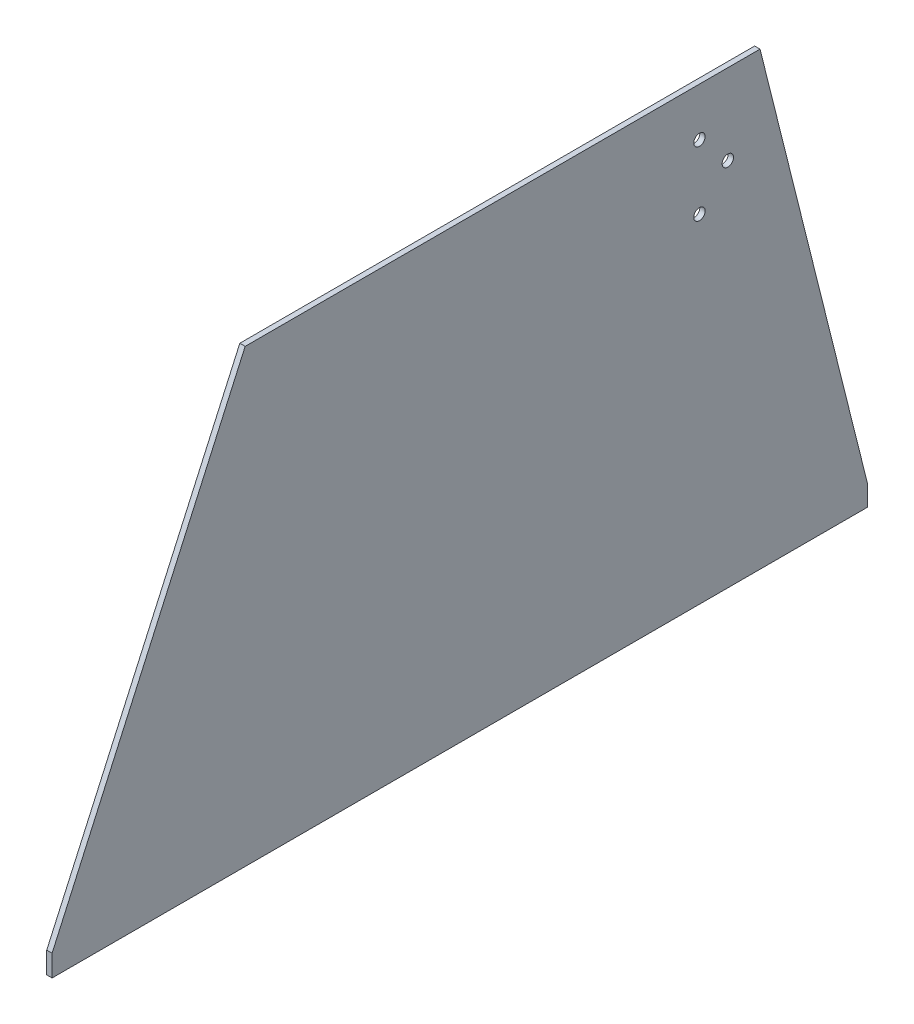
ISO-10303-21;
HEADER;
FILE_DESCRIPTION(('STEP AP214'),'2;1');
FILE_NAME('part.step','',(''),(''),'','','');
FILE_SCHEMA(('AUTOMOTIVE_DESIGN { 1 0 10303 214 1 1 1 1 }'));
ENDSEC;
DATA;
#1=APPLICATION_CONTEXT('core data for automotive mechanical design processes');
#2=APPLICATION_PROTOCOL_DEFINITION('international standard','automotive_design',2000,#1);
#3=PRODUCT_CONTEXT('',#1,'mechanical');
#4=PRODUCT('Part','Part','',(#3));
#5=PRODUCT_RELATED_PRODUCT_CATEGORY('part','',(#4));
#6=PRODUCT_DEFINITION_FORMATION('','',#4);
#7=PRODUCT_DEFINITION_CONTEXT('part definition',#1,'design');
#8=PRODUCT_DEFINITION('design','',#6,#7);
#9=PRODUCT_DEFINITION_SHAPE('','',#8);
#10=(LENGTH_UNIT() NAMED_UNIT(*) SI_UNIT(.MILLI.,.METRE.));
#11=(NAMED_UNIT(*) PLANE_ANGLE_UNIT() SI_UNIT($,.RADIAN.));
#12=(NAMED_UNIT(*) SI_UNIT($,.STERADIAN.) SOLID_ANGLE_UNIT());
#13=UNCERTAINTY_MEASURE_WITH_UNIT(LENGTH_MEASURE(1.E-05),#10,'distance_accuracy_value','');
#14=(GEOMETRIC_REPRESENTATION_CONTEXT(3) GLOBAL_UNCERTAINTY_ASSIGNED_CONTEXT((#13)) GLOBAL_UNIT_ASSIGNED_CONTEXT((#10,
#11,#12)) REPRESENTATION_CONTEXT('',''));
#15=CARTESIAN_POINT('',(0.,0.,0.));
#16=DIRECTION('',(0.,0.,1.));
#17=DIRECTION('',(1.,0.,0.));
#18=AXIS2_PLACEMENT_3D('',#15,#16,#17);
#19=CARTESIAN_POINT('',(3.175,12.7,0.));
#20=DIRECTION('',(0.,0.,-1.));
#21=DIRECTION('',(-1.,0.,0.));
#22=AXIS2_PLACEMENT_3D('',#19,#20,#21);
#23=PLANE('',#22);
#24=DIRECTION('',(0.,-1.,0.));
#25=VECTOR('',#24,1.);
#26=CARTESIAN_POINT('',(0.,12.7,0.));
#27=LINE('',#26,#25);
#28=CARTESIAN_POINT('',(0.,12.7,0.));
#29=VERTEX_POINT('',#28);
#30=CARTESIAN_POINT('',(0.,0.,0.));
#31=VERTEX_POINT('',#30);
#32=EDGE_CURVE('E116',#29,#31,#27,.T.);
#33=ORIENTED_EDGE('',*,*,#32,.T.);
#34=DIRECTION('',(-1.,0.,0.));
#35=VECTOR('',#34,1.);
#36=CARTESIAN_POINT('',(3.175,0.,0.));
#37=LINE('',#36,#35);
#38=CARTESIAN_POINT('',(3.175,0.,0.));
#39=VERTEX_POINT('',#38);
#40=EDGE_CURVE('E11',#39,#31,#37,.T.);
#41=ORIENTED_EDGE('',*,*,#40,.F.);
#42=DIRECTION('',(0.,-1.,0.));
#43=VECTOR('',#42,1.);
#44=CARTESIAN_POINT('',(3.175,12.7,0.));
#45=LINE('',#44,#43);
#46=CARTESIAN_POINT('',(3.175,12.7,0.));
#47=VERTEX_POINT('',#46);
#48=EDGE_CURVE('E127',#47,#39,#45,.T.);
#49=ORIENTED_EDGE('',*,*,#48,.F.);
#50=DIRECTION('',(-1.,0.,0.));
#51=VECTOR('',#50,1.);
#52=CARTESIAN_POINT('',(3.175,12.7,0.));
#53=LINE('',#52,#51);
#54=EDGE_CURVE('E112',#47,#29,#53,.T.);
#55=ORIENTED_EDGE('',*,*,#54,.T.);
#56=EDGE_LOOP('',(#33,#41,#49,#55));
#57=FACE_BOUND('',#56,.T.);
#58=ADVANCED_FACE('F32',(#57),#23,.F.);
#59=CARTESIAN_POINT('',(3.175,0.,-482.6));
#60=DIRECTION('',(0.,1.,0.));
#61=DIRECTION('',(0.,0.,1.));
#62=AXIS2_PLACEMENT_3D('',#59,#60,#61);
#63=PLANE('',#62);
#64=DIRECTION('',(0.,0.,-1.));
#65=VECTOR('',#64,1.);
#66=CARTESIAN_POINT('',(0.,0.,-482.6));
#67=LINE('',#66,#65);
#68=CARTESIAN_POINT('',(0.,0.,-482.6));
#69=VERTEX_POINT('',#68);
#70=EDGE_CURVE('E119',#31,#69,#67,.T.);
#71=ORIENTED_EDGE('',*,*,#70,.T.);
#72=DIRECTION('',(-1.,0.,0.));
#73=VECTOR('',#72,1.);
#74=CARTESIAN_POINT('',(3.175,0.,-482.6));
#75=LINE('',#74,#73);
#76=CARTESIAN_POINT('',(3.175,0.,-482.6));
#77=VERTEX_POINT('',#76);
#78=EDGE_CURVE('E40',#77,#69,#75,.T.);
#79=ORIENTED_EDGE('',*,*,#78,.F.);
#80=DIRECTION('',(0.,0.,-1.));
#81=VECTOR('',#80,1.);
#82=CARTESIAN_POINT('',(3.175,0.,-482.6));
#83=LINE('',#82,#81);
#84=EDGE_CURVE('E85',#39,#77,#83,.T.);
#85=ORIENTED_EDGE('',*,*,#84,.F.);
#86=ORIENTED_EDGE('',*,*,#40,.T.);
#87=EDGE_LOOP('',(#71,#79,#85,#86));
#88=FACE_BOUND('',#87,.T.);
#89=ADVANCED_FACE('F152',(#88),#63,.F.);
#90=CARTESIAN_POINT('',(3.175,12.7,-482.6));
#91=DIRECTION('',(0.,0.,1.));
#92=DIRECTION('',(1.,0.,0.));
#93=AXIS2_PLACEMENT_3D('',#90,#91,#92);
#94=PLANE('',#93);
#95=DIRECTION('',(0.,1.,0.));
#96=VECTOR('',#95,1.);
#97=CARTESIAN_POINT('',(0.,12.7,-482.6));
#98=LINE('',#97,#96);
#99=CARTESIAN_POINT('',(0.,12.7,-482.6));
#100=VERTEX_POINT('',#99);
#101=EDGE_CURVE('E122',#69,#100,#98,.T.);
#102=ORIENTED_EDGE('',*,*,#101,.T.);
#103=DIRECTION('',(-1.,0.,0.));
#104=VECTOR('',#103,1.);
#105=CARTESIAN_POINT('',(3.175,12.7,-482.6));
#106=LINE('',#105,#104);
#107=CARTESIAN_POINT('',(3.175,12.7,-482.6));
#108=VERTEX_POINT('',#107);
#109=EDGE_CURVE('E107',#108,#100,#106,.T.);
#110=ORIENTED_EDGE('',*,*,#109,.F.);
#111=DIRECTION('',(0.,1.,0.));
#112=VECTOR('',#111,1.);
#113=CARTESIAN_POINT('',(3.175,12.7,-482.6));
#114=LINE('',#113,#112);
#115=EDGE_CURVE('E98',#77,#108,#114,.T.);
#116=ORIENTED_EDGE('',*,*,#115,.F.);
#117=ORIENTED_EDGE('',*,*,#78,.T.);
#118=EDGE_LOOP('',(#102,#110,#116,#117));
#119=FACE_BOUND('',#118,.T.);
#120=ADVANCED_FACE('F133',(#119),#94,.F.);
#121=CARTESIAN_POINT('',(3.175,266.7,-419.1));
#122=DIRECTION('',(0.,-0.242535625036333,0.970142500145332));
#123=DIRECTION('',(0.,-0.970142500145332,-0.242535625036333));
#124=AXIS2_PLACEMENT_3D('',#121,#122,#123);
#125=PLANE('',#124);
#126=DIRECTION('',(0.,0.970142500145332,0.242535625036333));
#127=VECTOR('',#126,1.);
#128=CARTESIAN_POINT('',(0.,266.7,-419.1));
#129=LINE('',#128,#127);
#130=CARTESIAN_POINT('',(0.,266.7,-419.1));
#131=VERTEX_POINT('',#130);
#132=EDGE_CURVE('E106',#100,#131,#129,.T.);
#133=ORIENTED_EDGE('',*,*,#132,.T.);
#134=DIRECTION('',(-1.,0.,0.));
#135=VECTOR('',#134,1.);
#136=CARTESIAN_POINT('',(3.175,266.7,-419.1));
#137=LINE('',#136,#135);
#138=CARTESIAN_POINT('',(3.175,266.7,-419.1));
#139=VERTEX_POINT('',#138);
#140=EDGE_CURVE('E103',#139,#131,#137,.T.);
#141=ORIENTED_EDGE('',*,*,#140,.F.);
#142=DIRECTION('',(0.,0.970142500145332,0.242535625036333));
#143=VECTOR('',#142,1.);
#144=CARTESIAN_POINT('',(3.175,266.7,-419.1));
#145=LINE('',#144,#143);
#146=EDGE_CURVE('E92',#108,#139,#145,.T.);
#147=ORIENTED_EDGE('',*,*,#146,.F.);
#148=ORIENTED_EDGE('',*,*,#109,.T.);
#149=EDGE_LOOP('',(#133,#141,#147,#148));
#150=FACE_BOUND('',#149,.T.);
#151=ADVANCED_FACE('F104',(#150),#125,.F.);
#152=CARTESIAN_POINT('',(3.175,266.7,-114.3));
#153=DIRECTION('',(0.,-1.,0.));
#154=DIRECTION('',(0.,0.,-1.));
#155=AXIS2_PLACEMENT_3D('',#152,#153,#154);
#156=PLANE('',#155);
#157=DIRECTION('',(0.,0.,1.));
#158=VECTOR('',#157,1.);
#159=CARTESIAN_POINT('',(0.,266.7,-114.3));
#160=LINE('',#159,#158);
#161=CARTESIAN_POINT('',(0.,266.7,-114.3));
#162=VERTEX_POINT('',#161);
#163=EDGE_CURVE('E71',#131,#162,#160,.T.);
#164=ORIENTED_EDGE('',*,*,#163,.T.);
#165=DIRECTION('',(-1.,0.,0.));
#166=VECTOR('',#165,1.);
#167=CARTESIAN_POINT('',(3.175,266.7,-114.3));
#168=LINE('',#167,#166);
#169=CARTESIAN_POINT('',(3.175,266.7,-114.3));
#170=VERTEX_POINT('',#169);
#171=EDGE_CURVE('E108',#170,#162,#168,.T.);
#172=ORIENTED_EDGE('',*,*,#171,.F.);
#173=DIRECTION('',(0.,0.,1.));
#174=VECTOR('',#173,1.);
#175=CARTESIAN_POINT('',(3.175,266.7,-114.3));
#176=LINE('',#175,#174);
#177=EDGE_CURVE('E96',#139,#170,#176,.T.);
#178=ORIENTED_EDGE('',*,*,#177,.F.);
#179=ORIENTED_EDGE('',*,*,#140,.T.);
#180=EDGE_LOOP('',(#164,#172,#178,#179));
#181=FACE_BOUND('',#180,.T.);
#182=ADVANCED_FACE('F110',(#181),#156,.F.);
#183=CARTESIAN_POINT('',(3.175,266.7,-114.3));
#184=DIRECTION('',(0.,-0.410364677328798,-0.911921505175106));
#185=DIRECTION('',(0.,0.911921505175106,-0.410364677328798));
#186=AXIS2_PLACEMENT_3D('',#183,#184,#185);
#187=PLANE('',#186);
#188=DIRECTION('',(0.,-0.911921505175106,0.410364677328798));
#189=VECTOR('',#188,1.);
#190=CARTESIAN_POINT('',(0.,266.7,-114.3));
#191=LINE('',#190,#189);
#192=EDGE_CURVE('E77',#162,#29,#191,.T.);
#193=ORIENTED_EDGE('',*,*,#192,.T.);
#194=ORIENTED_EDGE('',*,*,#54,.F.);
#195=DIRECTION('',(0.,-0.911921505175106,0.410364677328798));
#196=VECTOR('',#195,1.);
#197=CARTESIAN_POINT('',(3.175,266.7,-114.3));
#198=LINE('',#197,#196);
#199=EDGE_CURVE('E48',#170,#47,#198,.T.);
#200=ORIENTED_EDGE('',*,*,#199,.F.);
#201=ORIENTED_EDGE('',*,*,#171,.T.);
#202=EDGE_LOOP('',(#193,#194,#200,#201));
#203=FACE_BOUND('',#202,.T.);
#204=ADVANCED_FACE('F140',(#203),#187,.F.);
#205=CARTESIAN_POINT('',(3.175,0.,0.));
#206=DIRECTION('',(-1.,0.,0.));
#207=DIRECTION('',(0.,0.,1.));
#208=AXIS2_PLACEMENT_3D('',#205,#206,#207);
#209=PLANE('',#208);
#210=CARTESIAN_POINT('',(3.175,219.075,-400.05));
#211=DIRECTION('',(1.,0.,0.));
#212=DIRECTION('',(0.,0.,-1.));
#213=AXIS2_PLACEMENT_3D('',#210,#211,#212);
#214=CIRCLE('',#213,3.37819999999999);
#215=CARTESIAN_POINT('',(3.175,219.075,-403.4282));
#216=VERTEX_POINT('',#215);
#217=EDGE_CURVE('E227',#216,#216,#214,.T.);
#218=ORIENTED_EDGE('',*,*,#217,.F.);
#219=EDGE_LOOP('',(#218));
#220=FACE_BOUND('',#219,.T.);
#221=CARTESIAN_POINT('',(3.175,200.025,-383.24947917474));
#222=DIRECTION('',(1.,0.,0.));
#223=DIRECTION('',(0.,0.,-1.));
#224=AXIS2_PLACEMENT_3D('',#221,#222,#223);
#225=CIRCLE('',#224,3.37819999999999);
#226=CARTESIAN_POINT('',(3.175,200.025,-386.62767917474));
#227=VERTEX_POINT('',#226);
#228=EDGE_CURVE('E232',#227,#227,#225,.T.);
#229=ORIENTED_EDGE('',*,*,#228,.F.);
#230=EDGE_LOOP('',(#229));
#231=FACE_BOUND('',#230,.T.);
#232=CARTESIAN_POINT('',(3.175,238.125,-383.24947917474));
#233=DIRECTION('',(1.,0.,0.));
#234=DIRECTION('',(0.,0.,-1.));
#235=AXIS2_PLACEMENT_3D('',#232,#233,#234);
#236=CIRCLE('',#235,3.37819999999999);
#237=CARTESIAN_POINT('',(3.175,238.125,-386.62767917474));
#238=VERTEX_POINT('',#237);
#239=EDGE_CURVE('E240',#238,#238,#236,.T.);
#240=ORIENTED_EDGE('',*,*,#239,.F.);
#241=EDGE_LOOP('',(#240));
#242=FACE_BOUND('',#241,.T.);
#243=ORIENTED_EDGE('',*,*,#48,.T.);
#244=ORIENTED_EDGE('',*,*,#84,.T.);
#245=ORIENTED_EDGE('',*,*,#115,.T.);
#246=ORIENTED_EDGE('',*,*,#146,.T.);
#247=ORIENTED_EDGE('',*,*,#177,.T.);
#248=ORIENTED_EDGE('',*,*,#199,.T.);
#249=EDGE_LOOP('',(#243,#244,#245,#246,#247,#248));
#250=FACE_BOUND('',#249,.T.);
#251=ADVANCED_FACE('F94',(#220,#231,#242,#250),#209,.F.);
#252=CARTESIAN_POINT('',(0.,0.,0.));
#253=DIRECTION('',(-1.,0.,0.));
#254=DIRECTION('',(0.,0.,1.));
#255=AXIS2_PLACEMENT_3D('',#252,#253,#254);
#256=PLANE('',#255);
#257=CARTESIAN_POINT('',(0.,219.075,-400.05));
#258=DIRECTION('',(1.,0.,0.));
#259=DIRECTION('',(0.,0.,-1.));
#260=AXIS2_PLACEMENT_3D('',#257,#258,#259);
#261=CIRCLE('',#260,3.37819999999999);
#262=CARTESIAN_POINT('',(0.,219.075,-403.4282));
#263=VERTEX_POINT('',#262);
#264=EDGE_CURVE('E120',#263,#263,#261,.T.);
#265=ORIENTED_EDGE('',*,*,#264,.T.);
#266=EDGE_LOOP('',(#265));
#267=FACE_BOUND('',#266,.T.);
#268=CARTESIAN_POINT('',(0.,200.025,-383.24947917474));
#269=DIRECTION('',(1.,0.,0.));
#270=DIRECTION('',(0.,0.,-1.));
#271=AXIS2_PLACEMENT_3D('',#268,#269,#270);
#272=CIRCLE('',#271,3.37819999999999);
#273=CARTESIAN_POINT('',(0.,200.025,-386.62767917474));
#274=VERTEX_POINT('',#273);
#275=EDGE_CURVE('E228',#274,#274,#272,.T.);
#276=ORIENTED_EDGE('',*,*,#275,.T.);
#277=EDGE_LOOP('',(#276));
#278=FACE_BOUND('',#277,.T.);
#279=CARTESIAN_POINT('',(0.,238.125,-383.24947917474));
#280=DIRECTION('',(1.,0.,0.));
#281=DIRECTION('',(0.,0.,-1.));
#282=AXIS2_PLACEMENT_3D('',#279,#280,#281);
#283=CIRCLE('',#282,3.37819999999999);
#284=CARTESIAN_POINT('',(0.,238.125,-386.62767917474));
#285=VERTEX_POINT('',#284);
#286=EDGE_CURVE('E237',#285,#285,#283,.T.);
#287=ORIENTED_EDGE('',*,*,#286,.T.);
#288=EDGE_LOOP('',(#287));
#289=FACE_BOUND('',#288,.T.);
#290=ORIENTED_EDGE('',*,*,#32,.F.);
#291=ORIENTED_EDGE('',*,*,#192,.F.);
#292=ORIENTED_EDGE('',*,*,#163,.F.);
#293=ORIENTED_EDGE('',*,*,#132,.F.);
#294=ORIENTED_EDGE('',*,*,#101,.F.);
#295=ORIENTED_EDGE('',*,*,#70,.F.);
#296=EDGE_LOOP('',(#290,#291,#292,#293,#294,#295));
#297=FACE_BOUND('',#296,.T.);
#298=ADVANCED_FACE('F136',(#267,#278,#289,#297),#256,.T.);
#299=CARTESIAN_POINT('',(0.,238.125,-383.24947917474));
#300=DIRECTION('',(1.,0.,0.));
#301=DIRECTION('',(0.,0.,-1.));
#302=AXIS2_PLACEMENT_3D('',#299,#300,#301);
#303=CYLINDRICAL_SURFACE('',#302,3.37819999999999);
#304=ORIENTED_EDGE('',*,*,#286,.F.);
#305=EDGE_LOOP('',(#304));
#306=FACE_BOUND('',#305,.T.);
#307=ORIENTED_EDGE('',*,*,#239,.T.);
#308=EDGE_LOOP('',(#307));
#309=FACE_BOUND('',#308,.T.);
#310=ADVANCED_FACE('F189',(#306,#309),#303,.F.);
#311=CARTESIAN_POINT('',(0.,200.025,-383.24947917474));
#312=DIRECTION('',(1.,0.,0.));
#313=DIRECTION('',(0.,0.,-1.));
#314=AXIS2_PLACEMENT_3D('',#311,#312,#313);
#315=CYLINDRICAL_SURFACE('',#314,3.37819999999999);
#316=ORIENTED_EDGE('',*,*,#275,.F.);
#317=EDGE_LOOP('',(#316));
#318=FACE_BOUND('',#317,.T.);
#319=ORIENTED_EDGE('',*,*,#228,.T.);
#320=EDGE_LOOP('',(#319));
#321=FACE_BOUND('',#320,.T.);
#322=ADVANCED_FACE('F198',(#318,#321),#315,.F.);
#323=CARTESIAN_POINT('',(0.,219.075,-400.05));
#324=DIRECTION('',(1.,0.,0.));
#325=DIRECTION('',(0.,0.,-1.));
#326=AXIS2_PLACEMENT_3D('',#323,#324,#325);
#327=CYLINDRICAL_SURFACE('',#326,3.37819999999999);
#328=ORIENTED_EDGE('',*,*,#264,.F.);
#329=EDGE_LOOP('',(#328));
#330=FACE_BOUND('',#329,.T.);
#331=ORIENTED_EDGE('',*,*,#217,.T.);
#332=EDGE_LOOP('',(#331));
#333=FACE_BOUND('',#332,.T.);
#334=ADVANCED_FACE('F208',(#330,#333),#327,.F.);
#335=CLOSED_SHELL('',(#58,#89,#120,#151,#182,#204,#251,#298,#310,#322,#334));
#336=MANIFOLD_SOLID_BREP('B2',#335);
#337=ADVANCED_BREP_SHAPE_REPRESENTATION('',(#18,#336),#14);
#338=SHAPE_DEFINITION_REPRESENTATION(#9,#337);
ENDSEC;
END-ISO-10303-21;
